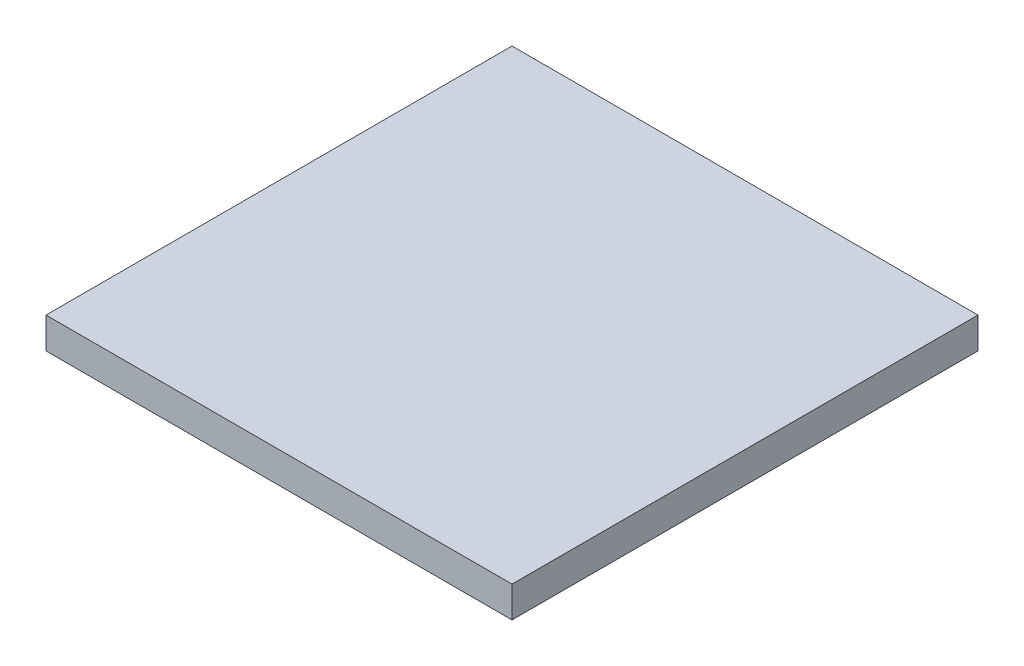
ISO-10303-21;
HEADER;
FILE_DESCRIPTION(('STEP AP214'),'2;1');
FILE_NAME('part.step','',(''),(''),'','','');
FILE_SCHEMA(('AUTOMOTIVE_DESIGN { 1 0 10303 214 1 1 1 1 }'));
ENDSEC;
DATA;
#1=APPLICATION_CONTEXT('core data for automotive mechanical design processes');
#2=APPLICATION_PROTOCOL_DEFINITION('international standard','automotive_design',2000,#1);
#3=PRODUCT_CONTEXT('',#1,'mechanical');
#4=PRODUCT('Part','Part','',(#3));
#5=PRODUCT_RELATED_PRODUCT_CATEGORY('part','',(#4));
#6=PRODUCT_DEFINITION_FORMATION('','',#4);
#7=PRODUCT_DEFINITION_CONTEXT('part definition',#1,'design');
#8=PRODUCT_DEFINITION('design','',#6,#7);
#9=PRODUCT_DEFINITION_SHAPE('','',#8);
#10=(LENGTH_UNIT() NAMED_UNIT(*) SI_UNIT(.MILLI.,.METRE.));
#11=(NAMED_UNIT(*) PLANE_ANGLE_UNIT() SI_UNIT($,.RADIAN.));
#12=(NAMED_UNIT(*) SI_UNIT($,.STERADIAN.) SOLID_ANGLE_UNIT());
#13=UNCERTAINTY_MEASURE_WITH_UNIT(LENGTH_MEASURE(1.E-05),#10,'distance_accuracy_value','');
#14=(GEOMETRIC_REPRESENTATION_CONTEXT(3) GLOBAL_UNCERTAINTY_ASSIGNED_CONTEXT((#13)) GLOBAL_UNIT_ASSIGNED_CONTEXT((#10,
#11,#12)) REPRESENTATION_CONTEXT('',''));
#15=CARTESIAN_POINT('',(0.,0.,0.));
#16=DIRECTION('',(0.,0.,1.));
#17=DIRECTION('',(1.,0.,0.));
#18=AXIS2_PLACEMENT_3D('',#15,#16,#17);
#19=CARTESIAN_POINT('',(7.5,1.,-7.5));
#20=DIRECTION('',(-1.,0.,0.));
#21=DIRECTION('',(0.,0.,1.));
#22=AXIS2_PLACEMENT_3D('',#19,#20,#21);
#23=PLANE('',#22);
#24=DIRECTION('',(0.,0.,-1.));
#25=VECTOR('',#24,1.);
#26=CARTESIAN_POINT('',(7.5,0.,-7.5));
#27=LINE('',#26,#25);
#28=CARTESIAN_POINT('',(7.5,0.,7.5));
#29=VERTEX_POINT('',#28);
#30=CARTESIAN_POINT('',(7.5,0.,-7.5));
#31=VERTEX_POINT('',#30);
#32=EDGE_CURVE('E97',#29,#31,#27,.T.);
#33=ORIENTED_EDGE('',*,*,#32,.T.);
#34=DIRECTION('',(0.,-1.,0.));
#35=VECTOR('',#34,1.);
#36=CARTESIAN_POINT('',(7.5,1.,-7.5));
#37=LINE('',#36,#35);
#38=CARTESIAN_POINT('',(7.5,1.,-7.5));
#39=VERTEX_POINT('',#38);
#40=EDGE_CURVE('E11',#39,#31,#37,.T.);
#41=ORIENTED_EDGE('',*,*,#40,.F.);
#42=DIRECTION('',(0.,0.,-1.));
#43=VECTOR('',#42,1.);
#44=CARTESIAN_POINT('',(7.5,1.,-7.5));
#45=LINE('',#44,#43);
#46=CARTESIAN_POINT('',(7.5,1.,7.5));
#47=VERTEX_POINT('',#46);
#48=EDGE_CURVE('E85',#47,#39,#45,.T.);
#49=ORIENTED_EDGE('',*,*,#48,.F.);
#50=DIRECTION('',(0.,-1.,0.));
#51=VECTOR('',#50,1.);
#52=CARTESIAN_POINT('',(7.5,1.,7.5));
#53=LINE('',#52,#51);
#54=EDGE_CURVE('E93',#47,#29,#53,.T.);
#55=ORIENTED_EDGE('',*,*,#54,.T.);
#56=EDGE_LOOP('',(#33,#41,#49,#55));
#57=FACE_BOUND('',#56,.T.);
#58=ADVANCED_FACE('F34',(#57),#23,.F.);
#59=CARTESIAN_POINT('',(-7.5,1.,-7.5));
#60=DIRECTION('',(0.,0.,1.));
#61=DIRECTION('',(1.,0.,0.));
#62=AXIS2_PLACEMENT_3D('',#59,#60,#61);
#63=PLANE('',#62);
#64=DIRECTION('',(-1.,0.,0.));
#65=VECTOR('',#64,1.);
#66=CARTESIAN_POINT('',(-7.5,0.,-7.5));
#67=LINE('',#66,#65);
#68=CARTESIAN_POINT('',(-7.5,0.,-7.5));
#69=VERTEX_POINT('',#68);
#70=EDGE_CURVE('E89',#31,#69,#67,.T.);
#71=ORIENTED_EDGE('',*,*,#70,.T.);
#72=DIRECTION('',(0.,-1.,0.));
#73=VECTOR('',#72,1.);
#74=CARTESIAN_POINT('',(-7.5,1.,-7.5));
#75=LINE('',#74,#73);
#76=CARTESIAN_POINT('',(-7.5,1.,-7.5));
#77=VERTEX_POINT('',#76);
#78=EDGE_CURVE('E42',#77,#69,#75,.T.);
#79=ORIENTED_EDGE('',*,*,#78,.F.);
#80=DIRECTION('',(-1.,0.,0.));
#81=VECTOR('',#80,1.);
#82=CARTESIAN_POINT('',(-7.5,1.,-7.5));
#83=LINE('',#82,#81);
#84=EDGE_CURVE('E80',#39,#77,#83,.T.);
#85=ORIENTED_EDGE('',*,*,#84,.F.);
#86=ORIENTED_EDGE('',*,*,#40,.T.);
#87=EDGE_LOOP('',(#71,#79,#85,#86));
#88=FACE_BOUND('',#87,.T.);
#89=ADVANCED_FACE('F88',(#88),#63,.F.);
#90=CARTESIAN_POINT('',(-7.5,1.,-7.5));
#91=DIRECTION('',(1.,0.,0.));
#92=DIRECTION('',(0.,0.,-1.));
#93=AXIS2_PLACEMENT_3D('',#90,#91,#92);
#94=PLANE('',#93);
#95=DIRECTION('',(0.,0.,1.));
#96=VECTOR('',#95,1.);
#97=CARTESIAN_POINT('',(-7.5,0.,-7.5));
#98=LINE('',#97,#96);
#99=CARTESIAN_POINT('',(-7.5,0.,7.5));
#100=VERTEX_POINT('',#99);
#101=EDGE_CURVE('E67',#69,#100,#98,.T.);
#102=ORIENTED_EDGE('',*,*,#101,.T.);
#103=DIRECTION('',(0.,-1.,0.));
#104=VECTOR('',#103,1.);
#105=CARTESIAN_POINT('',(-7.5,1.,7.5));
#106=LINE('',#105,#104);
#107=CARTESIAN_POINT('',(-7.5,1.,7.5));
#108=VERTEX_POINT('',#107);
#109=EDGE_CURVE('E90',#108,#100,#106,.T.);
#110=ORIENTED_EDGE('',*,*,#109,.F.);
#111=DIRECTION('',(0.,0.,1.));
#112=VECTOR('',#111,1.);
#113=CARTESIAN_POINT('',(-7.5,1.,-7.5));
#114=LINE('',#113,#112);
#115=EDGE_CURVE('E83',#77,#108,#114,.T.);
#116=ORIENTED_EDGE('',*,*,#115,.F.);
#117=ORIENTED_EDGE('',*,*,#78,.T.);
#118=EDGE_LOOP('',(#102,#110,#116,#117));
#119=FACE_BOUND('',#118,.T.);
#120=ADVANCED_FACE('F91',(#119),#94,.F.);
#121=CARTESIAN_POINT('',(-7.5,1.,7.5));
#122=DIRECTION('',(0.,0.,-1.));
#123=DIRECTION('',(-1.,0.,0.));
#124=AXIS2_PLACEMENT_3D('',#121,#122,#123);
#125=PLANE('',#124);
#126=DIRECTION('',(1.,0.,0.));
#127=VECTOR('',#126,1.);
#128=CARTESIAN_POINT('',(-7.5,0.,7.5));
#129=LINE('',#128,#127);
#130=EDGE_CURVE('E73',#100,#29,#129,.T.);
#131=ORIENTED_EDGE('',*,*,#130,.T.);
#132=ORIENTED_EDGE('',*,*,#54,.F.);
#133=DIRECTION('',(1.,0.,0.));
#134=VECTOR('',#133,1.);
#135=CARTESIAN_POINT('',(-7.5,1.,7.5));
#136=LINE('',#135,#134);
#137=EDGE_CURVE('E50',#108,#47,#136,.T.);
#138=ORIENTED_EDGE('',*,*,#137,.F.);
#139=ORIENTED_EDGE('',*,*,#109,.T.);
#140=EDGE_LOOP('',(#131,#132,#138,#139));
#141=FACE_BOUND('',#140,.T.);
#142=ADVANCED_FACE('F104',(#141),#125,.F.);
#143=CARTESIAN_POINT('',(0.,1.,0.));
#144=DIRECTION('',(0.,1.,0.));
#145=DIRECTION('',(0.,0.,1.));
#146=AXIS2_PLACEMENT_3D('',#143,#144,#145);
#147=PLANE('',#146);
#148=ORIENTED_EDGE('',*,*,#48,.T.);
#149=ORIENTED_EDGE('',*,*,#84,.T.);
#150=ORIENTED_EDGE('',*,*,#115,.T.);
#151=ORIENTED_EDGE('',*,*,#137,.T.);
#152=EDGE_LOOP('',(#148,#149,#150,#151));
#153=FACE_BOUND('',#152,.T.);
#154=ADVANCED_FACE('F81',(#153),#147,.T.);
#155=CARTESIAN_POINT('',(0.,0.,0.));
#156=DIRECTION('',(0.,1.,0.));
#157=DIRECTION('',(0.,0.,1.));
#158=AXIS2_PLACEMENT_3D('',#155,#156,#157);
#159=PLANE('',#158);
#160=ORIENTED_EDGE('',*,*,#32,.F.);
#161=ORIENTED_EDGE('',*,*,#130,.F.);
#162=ORIENTED_EDGE('',*,*,#101,.F.);
#163=ORIENTED_EDGE('',*,*,#70,.F.);
#164=EDGE_LOOP('',(#160,#161,#162,#163));
#165=FACE_BOUND('',#164,.T.);
#166=ADVANCED_FACE('F107',(#165),#159,.F.);
#167=CLOSED_SHELL('',(#58,#89,#120,#142,#154,#166));
#168=MANIFOLD_SOLID_BREP('B2',#167);
#169=ADVANCED_BREP_SHAPE_REPRESENTATION('',(#18,#168),#14);
#170=SHAPE_DEFINITION_REPRESENTATION(#9,#169);
ENDSEC;
END-ISO-10303-21;
